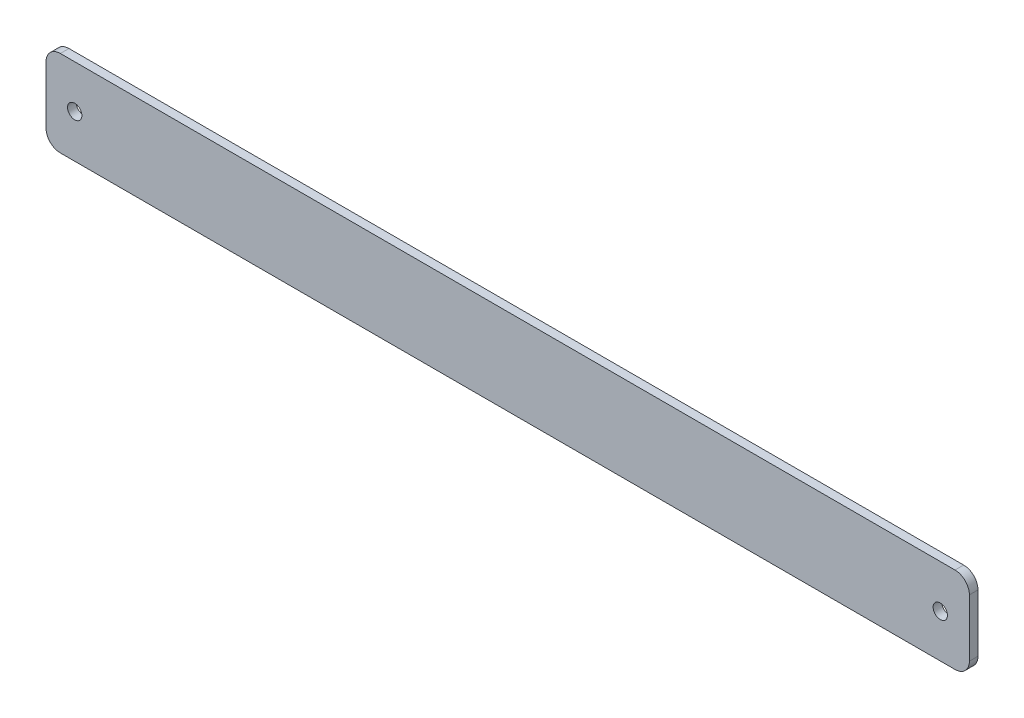
ISO-10303-21;
HEADER;
FILE_DESCRIPTION(('STEP AP214'),'2;1');
FILE_NAME('part.step','',(''),(''),'','','');
FILE_SCHEMA(('AUTOMOTIVE_DESIGN { 1 0 10303 214 1 1 1 1 }'));
ENDSEC;
DATA;
#1=APPLICATION_CONTEXT('core data for automotive mechanical design processes');
#2=APPLICATION_PROTOCOL_DEFINITION('international standard','automotive_design',2000,#1);
#3=PRODUCT_CONTEXT('',#1,'mechanical');
#4=PRODUCT('Part','Part','',(#3));
#5=PRODUCT_RELATED_PRODUCT_CATEGORY('part','',(#4));
#6=PRODUCT_DEFINITION_FORMATION('','',#4);
#7=PRODUCT_DEFINITION_CONTEXT('part definition',#1,'design');
#8=PRODUCT_DEFINITION('design','',#6,#7);
#9=PRODUCT_DEFINITION_SHAPE('','',#8);
#10=(LENGTH_UNIT() NAMED_UNIT(*) SI_UNIT(.MILLI.,.METRE.));
#11=(NAMED_UNIT(*) PLANE_ANGLE_UNIT() SI_UNIT($,.RADIAN.));
#12=(NAMED_UNIT(*) SI_UNIT($,.STERADIAN.) SOLID_ANGLE_UNIT());
#13=UNCERTAINTY_MEASURE_WITH_UNIT(LENGTH_MEASURE(1.E-05),#10,'distance_accuracy_value','');
#14=(GEOMETRIC_REPRESENTATION_CONTEXT(3) GLOBAL_UNCERTAINTY_ASSIGNED_CONTEXT((#13)) GLOBAL_UNIT_ASSIGNED_CONTEXT((#10,
#11,#12)) REPRESENTATION_CONTEXT('',''));
#15=CARTESIAN_POINT('',(0.,0.,0.));
#16=DIRECTION('',(0.,0.,1.));
#17=DIRECTION('',(1.,0.,0.));
#18=AXIS2_PLACEMENT_3D('',#15,#16,#17);
#19=CARTESIAN_POINT('',(155.75,10.,3.));
#20=DIRECTION('',(0.,0.,-1.));
#21=DIRECTION('',(-1.,0.,0.));
#22=AXIS2_PLACEMENT_3D('',#19,#20,#21);
#23=CYLINDRICAL_SURFACE('',#22,5.);
#24=CARTESIAN_POINT('',(155.75,10.,0.));
#25=DIRECTION('',(0.,0.,1.));
#26=DIRECTION('',(1.,0.,0.));
#27=AXIS2_PLACEMENT_3D('',#24,#25,#26);
#28=CIRCLE('',#27,5.);
#29=CARTESIAN_POINT('',(155.75,15.,0.));
#30=VERTEX_POINT('',#29);
#31=CARTESIAN_POINT('',(160.75,9.99999999999998,0.));
#32=VERTEX_POINT('',#31);
#33=EDGE_CURVE('E153',#30,#32,#28,.F.);
#34=ORIENTED_EDGE('',*,*,#33,.F.);
#35=DIRECTION('',(0.,0.,-1.));
#36=VECTOR('',#35,1.);
#37=CARTESIAN_POINT('',(155.75,15.,3.));
#38=LINE('',#37,#36);
#39=CARTESIAN_POINT('',(155.75,15.,3.));
#40=VERTEX_POINT('',#39);
#41=EDGE_CURVE('E11',#40,#30,#38,.T.);
#42=ORIENTED_EDGE('',*,*,#41,.F.);
#43=CARTESIAN_POINT('',(155.75,10.,3.));
#44=DIRECTION('',(0.,0.,1.));
#45=DIRECTION('',(1.,0.,0.));
#46=AXIS2_PLACEMENT_3D('',#43,#44,#45);
#47=CIRCLE('',#46,5.);
#48=CARTESIAN_POINT('',(160.75,9.99999999999998,3.));
#49=VERTEX_POINT('',#48);
#50=EDGE_CURVE('E179',#40,#49,#47,.F.);
#51=ORIENTED_EDGE('',*,*,#50,.T.);
#52=DIRECTION('',(0.,0.,-1.));
#53=VECTOR('',#52,1.);
#54=CARTESIAN_POINT('',(160.75,9.99999999999998,3.));
#55=LINE('',#54,#53);
#56=EDGE_CURVE('E70',#49,#32,#55,.T.);
#57=ORIENTED_EDGE('',*,*,#56,.T.);
#58=EDGE_LOOP('',(#34,#42,#51,#57));
#59=FACE_BOUND('',#58,.T.);
#60=ADVANCED_FACE('F53',(#59),#23,.T.);
#61=CARTESIAN_POINT('',(0.,15.,3.));
#62=DIRECTION('',(0.,1.,0.));
#63=DIRECTION('',(0.,0.,1.));
#64=AXIS2_PLACEMENT_3D('',#61,#62,#63);
#65=PLANE('',#64);
#66=DIRECTION('',(1.,0.,0.));
#67=VECTOR('',#66,1.);
#68=CARTESIAN_POINT('',(0.,15.,0.));
#69=LINE('',#68,#67);
#70=CARTESIAN_POINT('',(-155.75,15.,0.));
#71=VERTEX_POINT('',#70);
#72=EDGE_CURVE('E156',#71,#30,#69,.T.);
#73=ORIENTED_EDGE('',*,*,#72,.F.);
#74=DIRECTION('',(0.,0.,-1.));
#75=VECTOR('',#74,1.);
#76=CARTESIAN_POINT('',(-155.75,15.,3.));
#77=LINE('',#76,#75);
#78=CARTESIAN_POINT('',(-155.75,15.,3.));
#79=VERTEX_POINT('',#78);
#80=EDGE_CURVE('E62',#79,#71,#77,.T.);
#81=ORIENTED_EDGE('',*,*,#80,.F.);
#82=DIRECTION('',(1.,0.,0.));
#83=VECTOR('',#82,1.);
#84=CARTESIAN_POINT('',(0.,15.,3.));
#85=LINE('',#84,#83);
#86=EDGE_CURVE('E209',#79,#40,#85,.T.);
#87=ORIENTED_EDGE('',*,*,#86,.T.);
#88=ORIENTED_EDGE('',*,*,#41,.T.);
#89=EDGE_LOOP('',(#73,#81,#87,#88));
#90=FACE_BOUND('',#89,.T.);
#91=ADVANCED_FACE('F208',(#90),#65,.T.);
#92=CARTESIAN_POINT('',(-155.75,10.,3.));
#93=DIRECTION('',(0.,0.,-1.));
#94=DIRECTION('',(-1.,0.,0.));
#95=AXIS2_PLACEMENT_3D('',#92,#93,#94);
#96=CYLINDRICAL_SURFACE('',#95,5.);
#97=CARTESIAN_POINT('',(-155.75,10.,0.));
#98=DIRECTION('',(0.,0.,1.));
#99=DIRECTION('',(1.,0.,0.));
#100=AXIS2_PLACEMENT_3D('',#97,#98,#99);
#101=CIRCLE('',#100,5.);
#102=CARTESIAN_POINT('',(-160.75,9.99999999999998,0.));
#103=VERTEX_POINT('',#102);
#104=EDGE_CURVE('E161',#71,#103,#101,.T.);
#105=ORIENTED_EDGE('',*,*,#104,.T.);
#106=DIRECTION('',(0.,0.,-1.));
#107=VECTOR('',#106,1.);
#108=CARTESIAN_POINT('',(-160.75,9.99999999999998,3.));
#109=LINE('',#108,#107);
#110=CARTESIAN_POINT('',(-160.75,9.99999999999998,3.));
#111=VERTEX_POINT('',#110);
#112=EDGE_CURVE('E190',#111,#103,#109,.T.);
#113=ORIENTED_EDGE('',*,*,#112,.F.);
#114=CARTESIAN_POINT('',(-155.75,10.,3.));
#115=DIRECTION('',(0.,0.,1.));
#116=DIRECTION('',(1.,0.,0.));
#117=AXIS2_PLACEMENT_3D('',#114,#115,#116);
#118=CIRCLE('',#117,5.);
#119=EDGE_CURVE('E199',#79,#111,#118,.T.);
#120=ORIENTED_EDGE('',*,*,#119,.F.);
#121=ORIENTED_EDGE('',*,*,#80,.T.);
#122=EDGE_LOOP('',(#105,#113,#120,#121));
#123=FACE_BOUND('',#122,.T.);
#124=ADVANCED_FACE('F197',(#123),#96,.T.);
#125=CARTESIAN_POINT('',(-160.75,0.,3.));
#126=DIRECTION('',(1.,0.,0.));
#127=DIRECTION('',(0.,0.,-1.));
#128=AXIS2_PLACEMENT_3D('',#125,#126,#127);
#129=PLANE('',#128);
#130=DIRECTION('',(0.,-1.,0.));
#131=VECTOR('',#130,1.);
#132=CARTESIAN_POINT('',(-160.75,0.,0.));
#133=LINE('',#132,#131);
#134=CARTESIAN_POINT('',(-160.75,-9.99999999999998,0.));
#135=VERTEX_POINT('',#134);
#136=EDGE_CURVE('E164',#103,#135,#133,.T.);
#137=ORIENTED_EDGE('',*,*,#136,.T.);
#138=DIRECTION('',(0.,0.,-1.));
#139=VECTOR('',#138,1.);
#140=CARTESIAN_POINT('',(-160.75,-9.99999999999998,3.));
#141=LINE('',#140,#139);
#142=CARTESIAN_POINT('',(-160.75,-9.99999999999998,3.));
#143=VERTEX_POINT('',#142);
#144=EDGE_CURVE('E186',#143,#135,#141,.T.);
#145=ORIENTED_EDGE('',*,*,#144,.F.);
#146=DIRECTION('',(0.,-1.,0.));
#147=VECTOR('',#146,1.);
#148=CARTESIAN_POINT('',(-160.75,0.,3.));
#149=LINE('',#148,#147);
#150=EDGE_CURVE('E368',#111,#143,#149,.T.);
#151=ORIENTED_EDGE('',*,*,#150,.F.);
#152=ORIENTED_EDGE('',*,*,#112,.T.);
#153=EDGE_LOOP('',(#137,#145,#151,#152));
#154=FACE_BOUND('',#153,.T.);
#155=ADVANCED_FACE('F225',(#154),#129,.F.);
#156=CARTESIAN_POINT('',(-155.75,-10.,3.));
#157=DIRECTION('',(0.,0.,-1.));
#158=DIRECTION('',(-1.,0.,0.));
#159=AXIS2_PLACEMENT_3D('',#156,#157,#158);
#160=CYLINDRICAL_SURFACE('',#159,5.);
#161=CARTESIAN_POINT('',(-155.75,-10.,0.));
#162=DIRECTION('',(0.,0.,1.));
#163=DIRECTION('',(1.,0.,0.));
#164=AXIS2_PLACEMENT_3D('',#161,#162,#163);
#165=CIRCLE('',#164,5.);
#166=CARTESIAN_POINT('',(-155.75,-15.,0.));
#167=VERTEX_POINT('',#166);
#168=EDGE_CURVE('E167',#135,#167,#165,.T.);
#169=ORIENTED_EDGE('',*,*,#168,.T.);
#170=DIRECTION('',(0.,0.,-1.));
#171=VECTOR('',#170,1.);
#172=CARTESIAN_POINT('',(-155.75,-15.,3.));
#173=LINE('',#172,#171);
#174=CARTESIAN_POINT('',(-155.75,-15.,3.));
#175=VERTEX_POINT('',#174);
#176=EDGE_CURVE('E141',#175,#167,#173,.T.);
#177=ORIENTED_EDGE('',*,*,#176,.F.);
#178=CARTESIAN_POINT('',(-155.75,-10.,3.));
#179=DIRECTION('',(0.,0.,1.));
#180=DIRECTION('',(1.,0.,0.));
#181=AXIS2_PLACEMENT_3D('',#178,#179,#180);
#182=CIRCLE('',#181,5.);
#183=EDGE_CURVE('E127',#143,#175,#182,.T.);
#184=ORIENTED_EDGE('',*,*,#183,.F.);
#185=ORIENTED_EDGE('',*,*,#144,.T.);
#186=EDGE_LOOP('',(#169,#177,#184,#185));
#187=FACE_BOUND('',#186,.T.);
#188=ADVANCED_FACE('F230',(#187),#160,.T.);
#189=CARTESIAN_POINT('',(0.,-15.,3.));
#190=DIRECTION('',(0.,1.,0.));
#191=DIRECTION('',(0.,0.,1.));
#192=AXIS2_PLACEMENT_3D('',#189,#190,#191);
#193=PLANE('',#192);
#194=DIRECTION('',(1.,0.,0.));
#195=VECTOR('',#194,1.);
#196=CARTESIAN_POINT('',(0.,-15.,0.));
#197=LINE('',#196,#195);
#198=CARTESIAN_POINT('',(155.75,-15.,0.));
#199=VERTEX_POINT('',#198);
#200=EDGE_CURVE('E137',#167,#199,#197,.T.);
#201=ORIENTED_EDGE('',*,*,#200,.T.);
#202=DIRECTION('',(0.,0.,-1.));
#203=VECTOR('',#202,1.);
#204=CARTESIAN_POINT('',(155.75,-15.,3.));
#205=LINE('',#204,#203);
#206=CARTESIAN_POINT('',(155.75,-15.,3.));
#207=VERTEX_POINT('',#206);
#208=EDGE_CURVE('E134',#207,#199,#205,.T.);
#209=ORIENTED_EDGE('',*,*,#208,.F.);
#210=DIRECTION('',(1.,0.,0.));
#211=VECTOR('',#210,1.);
#212=CARTESIAN_POINT('',(0.,-15.,3.));
#213=LINE('',#212,#211);
#214=EDGE_CURVE('E120',#175,#207,#213,.T.);
#215=ORIENTED_EDGE('',*,*,#214,.F.);
#216=ORIENTED_EDGE('',*,*,#176,.T.);
#217=EDGE_LOOP('',(#201,#209,#215,#216));
#218=FACE_BOUND('',#217,.T.);
#219=ADVANCED_FACE('F135',(#218),#193,.F.);
#220=CARTESIAN_POINT('',(155.75,-10.,3.));
#221=DIRECTION('',(0.,0.,-1.));
#222=DIRECTION('',(-1.,0.,0.));
#223=AXIS2_PLACEMENT_3D('',#220,#221,#222);
#224=CYLINDRICAL_SURFACE('',#223,5.);
#225=CARTESIAN_POINT('',(155.75,-10.,0.));
#226=DIRECTION('',(0.,0.,1.));
#227=DIRECTION('',(1.,0.,0.));
#228=AXIS2_PLACEMENT_3D('',#225,#226,#227);
#229=CIRCLE('',#228,5.);
#230=CARTESIAN_POINT('',(160.75,-9.99999999999998,0.));
#231=VERTEX_POINT('',#230);
#232=EDGE_CURVE('E172',#199,#231,#229,.T.);
#233=ORIENTED_EDGE('',*,*,#232,.T.);
#234=DIRECTION('',(0.,0.,-1.));
#235=VECTOR('',#234,1.);
#236=CARTESIAN_POINT('',(160.75,-9.99999999999998,3.));
#237=LINE('',#236,#235);
#238=CARTESIAN_POINT('',(160.75,-9.99999999999998,3.));
#239=VERTEX_POINT('',#238);
#240=EDGE_CURVE('E96',#239,#231,#237,.T.);
#241=ORIENTED_EDGE('',*,*,#240,.F.);
#242=CARTESIAN_POINT('',(155.75,-10.,3.));
#243=DIRECTION('',(0.,0.,1.));
#244=DIRECTION('',(1.,0.,0.));
#245=AXIS2_PLACEMENT_3D('',#242,#243,#244);
#246=CIRCLE('',#245,5.);
#247=EDGE_CURVE('E125',#207,#239,#246,.T.);
#248=ORIENTED_EDGE('',*,*,#247,.F.);
#249=ORIENTED_EDGE('',*,*,#208,.T.);
#250=EDGE_LOOP('',(#233,#241,#248,#249));
#251=FACE_BOUND('',#250,.T.);
#252=ADVANCED_FACE('F143',(#251),#224,.T.);
#253=CARTESIAN_POINT('',(160.75,0.,3.));
#254=DIRECTION('',(1.,0.,0.));
#255=DIRECTION('',(0.,0.,-1.));
#256=AXIS2_PLACEMENT_3D('',#253,#254,#255);
#257=PLANE('',#256);
#258=DIRECTION('',(0.,-1.,0.));
#259=VECTOR('',#258,1.);
#260=CARTESIAN_POINT('',(160.75,0.,0.));
#261=LINE('',#260,#259);
#262=EDGE_CURVE('E175',#32,#231,#261,.T.);
#263=ORIENTED_EDGE('',*,*,#262,.F.);
#264=ORIENTED_EDGE('',*,*,#56,.F.);
#265=DIRECTION('',(0.,-1.,0.));
#266=VECTOR('',#265,1.);
#267=CARTESIAN_POINT('',(160.75,0.,3.));
#268=LINE('',#267,#266);
#269=EDGE_CURVE('E145',#49,#239,#268,.T.);
#270=ORIENTED_EDGE('',*,*,#269,.T.);
#271=ORIENTED_EDGE('',*,*,#240,.T.);
#272=EDGE_LOOP('',(#263,#264,#270,#271));
#273=FACE_BOUND('',#272,.T.);
#274=ADVANCED_FACE('F210',(#273),#257,.T.);
#275=CARTESIAN_POINT('',(0.,0.,3.));
#276=DIRECTION('',(0.,0.,1.));
#277=DIRECTION('',(1.,0.,0.));
#278=AXIS2_PLACEMENT_3D('',#275,#276,#277);
#279=PLANE('',#278);
#280=CARTESIAN_POINT('',(150.620541102025,0.,3.));
#281=DIRECTION('',(0.,0.,-1.));
#282=DIRECTION('',(-1.,0.,0.));
#283=AXIS2_PLACEMENT_3D('',#280,#281,#282);
#284=CIRCLE('',#283,2.5);
#285=CARTESIAN_POINT('',(148.120541102025,0.,3.));
#286=VERTEX_POINT('',#285);
#287=EDGE_CURVE('E157',#286,#286,#284,.T.);
#288=ORIENTED_EDGE('',*,*,#287,.T.);
#289=EDGE_LOOP('',(#288));
#290=FACE_BOUND('',#289,.T.);
#291=CARTESIAN_POINT('',(-150.75,0.,3.));
#292=DIRECTION('',(0.,0.,-1.));
#293=DIRECTION('',(-1.,0.,0.));
#294=AXIS2_PLACEMENT_3D('',#291,#292,#293);
#295=CIRCLE('',#294,2.5);
#296=CARTESIAN_POINT('',(-153.25,0.,3.));
#297=VERTEX_POINT('',#296);
#298=EDGE_CURVE('E356',#297,#297,#295,.T.);
#299=ORIENTED_EDGE('',*,*,#298,.T.);
#300=EDGE_LOOP('',(#299));
#301=FACE_BOUND('',#300,.T.);
#302=ORIENTED_EDGE('',*,*,#50,.F.);
#303=ORIENTED_EDGE('',*,*,#86,.F.);
#304=ORIENTED_EDGE('',*,*,#119,.T.);
#305=ORIENTED_EDGE('',*,*,#150,.T.);
#306=ORIENTED_EDGE('',*,*,#183,.T.);
#307=ORIENTED_EDGE('',*,*,#214,.T.);
#308=ORIENTED_EDGE('',*,*,#247,.T.);
#309=ORIENTED_EDGE('',*,*,#269,.F.);
#310=EDGE_LOOP('',(#302,#303,#304,#305,#306,#307,#308,#309));
#311=FACE_BOUND('',#310,.T.);
#312=ADVANCED_FACE('F122',(#290,#301,#311),#279,.T.);
#313=CARTESIAN_POINT('',(0.,0.,0.));
#314=DIRECTION('',(0.,0.,1.));
#315=DIRECTION('',(1.,0.,0.));
#316=AXIS2_PLACEMENT_3D('',#313,#314,#315);
#317=PLANE('',#316);
#318=CARTESIAN_POINT('',(150.620541102025,0.,0.));
#319=DIRECTION('',(0.,0.,-1.));
#320=DIRECTION('',(-1.,0.,0.));
#321=AXIS2_PLACEMENT_3D('',#318,#319,#320);
#322=CIRCLE('',#321,2.5);
#323=CARTESIAN_POINT('',(148.120541102025,0.,0.));
#324=VERTEX_POINT('',#323);
#325=EDGE_CURVE('E350',#324,#324,#322,.T.);
#326=ORIENTED_EDGE('',*,*,#325,.F.);
#327=EDGE_LOOP('',(#326));
#328=FACE_BOUND('',#327,.T.);
#329=CARTESIAN_POINT('',(-150.75,0.,0.));
#330=DIRECTION('',(0.,0.,-1.));
#331=DIRECTION('',(-1.,0.,0.));
#332=AXIS2_PLACEMENT_3D('',#329,#330,#331);
#333=CIRCLE('',#332,2.5);
#334=CARTESIAN_POINT('',(-153.25,0.,0.));
#335=VERTEX_POINT('',#334);
#336=EDGE_CURVE('E351',#335,#335,#333,.T.);
#337=ORIENTED_EDGE('',*,*,#336,.F.);
#338=EDGE_LOOP('',(#337));
#339=FACE_BOUND('',#338,.T.);
#340=ORIENTED_EDGE('',*,*,#33,.T.);
#341=ORIENTED_EDGE('',*,*,#262,.T.);
#342=ORIENTED_EDGE('',*,*,#232,.F.);
#343=ORIENTED_EDGE('',*,*,#200,.F.);
#344=ORIENTED_EDGE('',*,*,#168,.F.);
#345=ORIENTED_EDGE('',*,*,#136,.F.);
#346=ORIENTED_EDGE('',*,*,#104,.F.);
#347=ORIENTED_EDGE('',*,*,#72,.T.);
#348=EDGE_LOOP('',(#340,#341,#342,#343,#344,#345,#346,#347));
#349=FACE_BOUND('',#348,.T.);
#350=ADVANCED_FACE('F206',(#328,#339,#349),#317,.F.);
#351=CARTESIAN_POINT('',(-150.75,0.,3.));
#352=DIRECTION('',(0.,0.,-1.));
#353=DIRECTION('',(-1.,0.,0.));
#354=AXIS2_PLACEMENT_3D('',#351,#352,#353);
#355=CYLINDRICAL_SURFACE('',#354,2.5);
#356=ORIENTED_EDGE('',*,*,#298,.F.);
#357=EDGE_LOOP('',(#356));
#358=FACE_BOUND('',#357,.T.);
#359=ORIENTED_EDGE('',*,*,#336,.T.);
#360=EDGE_LOOP('',(#359));
#361=FACE_BOUND('',#360,.T.);
#362=ADVANCED_FACE('F264',(#358,#361),#355,.F.);
#363=CARTESIAN_POINT('',(150.620541102025,0.,3.));
#364=DIRECTION('',(0.,0.,-1.));
#365=DIRECTION('',(-1.,0.,0.));
#366=AXIS2_PLACEMENT_3D('',#363,#364,#365);
#367=CYLINDRICAL_SURFACE('',#366,2.5);
#368=ORIENTED_EDGE('',*,*,#287,.F.);
#369=EDGE_LOOP('',(#368));
#370=FACE_BOUND('',#369,.T.);
#371=ORIENTED_EDGE('',*,*,#325,.T.);
#372=EDGE_LOOP('',(#371));
#373=FACE_BOUND('',#372,.T.);
#374=ADVANCED_FACE('F273',(#370,#373),#367,.F.);
#375=CLOSED_SHELL('',(#60,#91,#124,#155,#188,#219,#252,#274,#312,#350,#362,#374));
#376=MANIFOLD_SOLID_BREP('B2',#375);
#377=ADVANCED_BREP_SHAPE_REPRESENTATION('',(#18,#376),#14);
#378=SHAPE_DEFINITION_REPRESENTATION(#9,#377);
ENDSEC;
END-ISO-10303-21;
